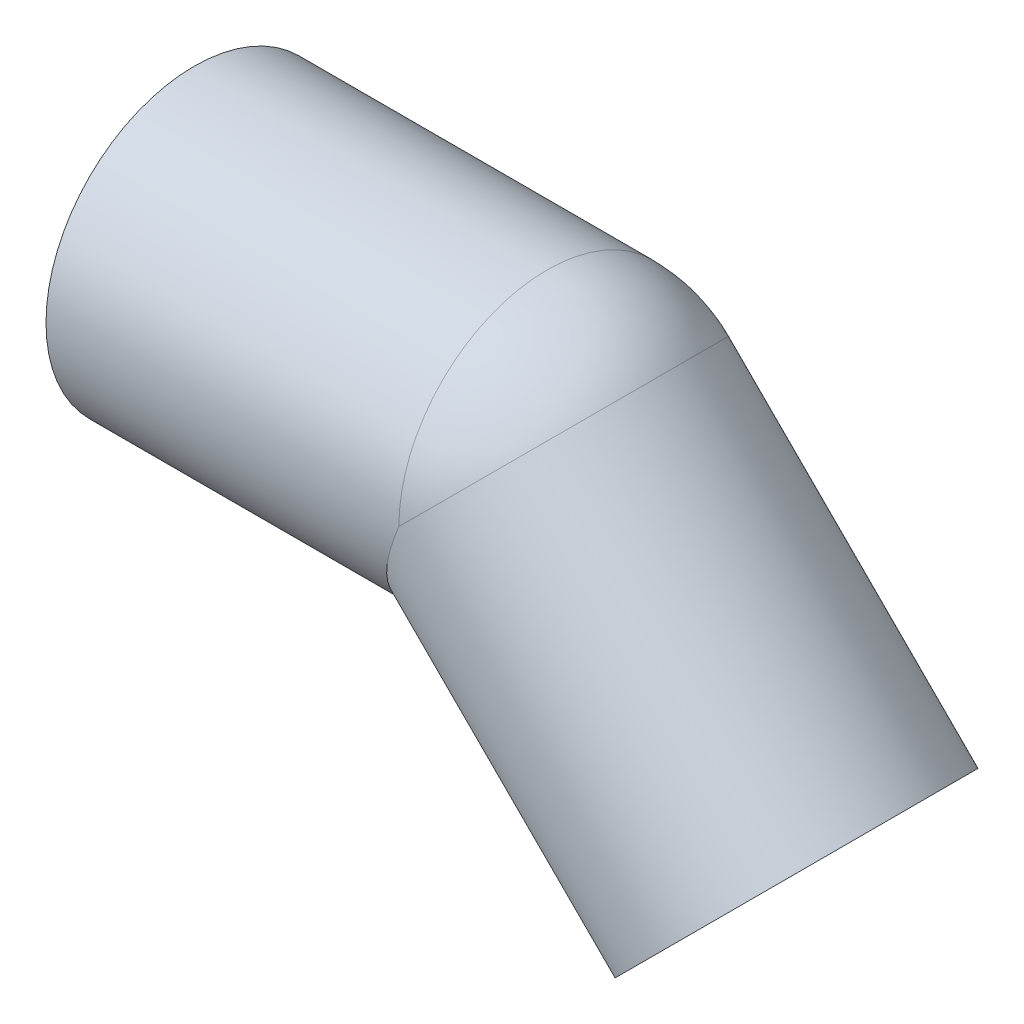
ISO-10303-21;
HEADER;
FILE_DESCRIPTION(('STEP AP214'),'2;1');
FILE_NAME('part.step','',(''),(''),'','','');
FILE_SCHEMA(('AUTOMOTIVE_DESIGN { 1 0 10303 214 1 1 1 1 }'));
ENDSEC;
DATA;
#1=APPLICATION_CONTEXT('core data for automotive mechanical design processes');
#2=APPLICATION_PROTOCOL_DEFINITION('international standard','automotive_design',2000,#1);
#3=PRODUCT_CONTEXT('',#1,'mechanical');
#4=PRODUCT('Part','Part','',(#3));
#5=PRODUCT_RELATED_PRODUCT_CATEGORY('part','',(#4));
#6=PRODUCT_DEFINITION_FORMATION('','',#4);
#7=PRODUCT_DEFINITION_CONTEXT('part definition',#1,'design');
#8=PRODUCT_DEFINITION('design','',#6,#7);
#9=PRODUCT_DEFINITION_SHAPE('','',#8);
#10=(LENGTH_UNIT() NAMED_UNIT(*) SI_UNIT(.MILLI.,.METRE.));
#11=(NAMED_UNIT(*) PLANE_ANGLE_UNIT() SI_UNIT($,.RADIAN.));
#12=(NAMED_UNIT(*) SI_UNIT($,.STERADIAN.) SOLID_ANGLE_UNIT());
#13=UNCERTAINTY_MEASURE_WITH_UNIT(LENGTH_MEASURE(1.E-05),#10,'distance_accuracy_value','');
#14=(GEOMETRIC_REPRESENTATION_CONTEXT(3) GLOBAL_UNCERTAINTY_ASSIGNED_CONTEXT((#13)) GLOBAL_UNIT_ASSIGNED_CONTEXT((#10,
#11,#12)) REPRESENTATION_CONTEXT('',''));
#15=CARTESIAN_POINT('',(0.,0.,0.));
#16=DIRECTION('',(0.,0.,1.));
#17=DIRECTION('',(1.,0.,0.));
#18=AXIS2_PLACEMENT_3D('',#15,#16,#17);
#19=CARTESIAN_POINT('',(128.033008588991,-53.033008588991,0.));
#20=DIRECTION('',(-0.70710678118655,0.707106781186546,0.));
#21=DIRECTION('',(-0.707106781186546,-0.70710678118655,0.));
#22=AXIS2_PLACEMENT_3D('',#19,#20,#21);
#23=CYLINDRICAL_SURFACE('',#22,28.5);
#24=CARTESIAN_POINT('',(75.,0.,0.));
#25=DIRECTION('',(0.707106781186547,-0.707106781186548,0.));
#26=DIRECTION('',(0.,0.,-1.));
#27=AXIS2_PLACEMENT_3D('',#24,#25,#26);
#28=CIRCLE('',#27,28.5);
#29=CARTESIAN_POINT('',(95.1525432656632,20.15254326197,0.));
#30=VERTEX_POINT('',#29);
#31=CARTESIAN_POINT('',(74.9999999999998,0.,28.5));
#32=VERTEX_POINT('',#31);
#33=EDGE_CURVE('E53',#30,#32,#28,.T.);
#34=ORIENTED_EDGE('',*,*,#33,.F.);
#35=CARTESIAN_POINT('',(75.,0.,0.));
#36=DIRECTION('',(0.707106780992169,-0.707106781380926,0.));
#37=DIRECTION('',(0.,0.,-1.));
#38=AXIS2_PLACEMENT_3D('',#35,#36,#37);
#39=CIRCLE('',#38,28.5);
#40=CARTESIAN_POINT('',(74.9999999999998,0.,-28.5));
#41=VERTEX_POINT('',#40);
#42=EDGE_CURVE('E46',#41,#30,#39,.T.);
#43=ORIENTED_EDGE('',*,*,#42,.F.);
#44=CARTESIAN_POINT('',(74.9999999999998,0.,0.));
#45=DIRECTION('',(-0.923879532511287,0.382683432365088,0.));
#46=DIRECTION('',(-0.382683432365088,-0.923879532511287,0.));
#47=AXIS2_PLACEMENT_3D('',#44,#45,#46);
#48=ELLIPSE('',#47,30.8481777083332,28.5);
#49=EDGE_CURVE('E55',#32,#41,#48,.F.);
#50=ORIENTED_EDGE('',*,*,#49,.F.);
#51=EDGE_LOOP('',(#34,#43,#50));
#52=FACE_BOUND('',#51,.T.);
#53=CARTESIAN_POINT('',(128.033008588991,-53.0330085889911,0.));
#54=DIRECTION('',(-0.707106781186549,0.707106781186546,0.));
#55=DIRECTION('',(-0.707106781186546,-0.707106781186549,0.));
#56=AXIS2_PLACEMENT_3D('',#53,#54,#55);
#57=CIRCLE('',#56,28.5);
#58=CARTESIAN_POINT('',(107.880465325175,-73.1855518528077,0.));
#59=VERTEX_POINT('',#58);
#60=EDGE_CURVE('E18',#59,#59,#57,.T.);
#61=ORIENTED_EDGE('',*,*,#60,.F.);
#62=EDGE_LOOP('',(#61));
#63=FACE_BOUND('',#62,.T.);
#64=ADVANCED_FACE('F15',(#52,#63),#23,.F.);
#65=CARTESIAN_POINT('',(75.,0.,0.));
#66=DIRECTION('',(0.,0.,1.));
#67=DIRECTION('',(-1.,0.,0.));
#68=AXIS2_PLACEMENT_3D('',#65,#66,#67);
#69=SPHERICAL_SURFACE('',#68,28.5);
#70=CARTESIAN_POINT('',(75.,0.,0.));
#71=DIRECTION('',(-1.,0.,0.));
#72=DIRECTION('',(0.,1.,0.));
#73=AXIS2_PLACEMENT_3D('',#70,#71,#72);
#74=CIRCLE('',#73,28.5);
#75=EDGE_CURVE('E51',#41,#32,#74,.F.);
#76=ORIENTED_EDGE('',*,*,#75,.F.);
#77=ORIENTED_EDGE('',*,*,#42,.T.);
#78=ORIENTED_EDGE('',*,*,#33,.T.);
#79=EDGE_LOOP('',(#76,#77,#78));
#80=FACE_BOUND('',#79,.T.);
#81=ADVANCED_FACE('F58',(#80),#69,.F.);
#82=CARTESIAN_POINT('',(150.306872196371,-30.7591449816114,31.878001054162));
#83=DIRECTION('',(0.707106781186547,-0.707106781186548,0.));
#84=DIRECTION('',(-0.707106781186548,-0.707106781186547,0.));
#85=AXIS2_PLACEMENT_3D('',#82,#83,#84);
#86=PLANE('',#85);
#87=ORIENTED_EDGE('',*,*,#60,.T.);
#88=EDGE_LOOP('',(#87));
#89=FACE_BOUND('',#88,.T.);
#90=CARTESIAN_POINT('',(128.033008588991,-53.0330085889911,0.));
#91=DIRECTION('',(-0.70710678118655,0.707106781186546,0.));
#92=DIRECTION('',(-0.707106781186546,-0.70710678118655,0.));
#93=AXIS2_PLACEMENT_3D('',#90,#91,#92);
#94=CIRCLE('',#93,31.5);
#95=CARTESIAN_POINT('',(105.759144981615,-75.3068721963674,0.));
#96=VERTEX_POINT('',#95);
#97=EDGE_CURVE('E75',#96,#96,#94,.T.);
#98=ORIENTED_EDGE('',*,*,#97,.F.);
#99=EDGE_LOOP('',(#98));
#100=FACE_BOUND('',#99,.T.);
#101=ADVANCED_FACE('F85',(#89,#100),#86,.T.);
#102=CARTESIAN_POINT('',(75.,0.,0.));
#103=DIRECTION('',(-1.,0.,0.));
#104=DIRECTION('',(0.,0.,1.));
#105=AXIS2_PLACEMENT_3D('',#102,#103,#104);
#106=CYLINDRICAL_SURFACE('',#105,28.5);
#107=CARTESIAN_POINT('',(0.,0.,0.));
#108=DIRECTION('',(-1.,0.,0.));
#109=DIRECTION('',(0.,0.,1.));
#110=AXIS2_PLACEMENT_3D('',#107,#108,#109);
#111=CIRCLE('',#110,28.5);
#112=CARTESIAN_POINT('',(0.,0.,28.5));
#113=VERTEX_POINT('',#112);
#114=EDGE_CURVE('E72',#113,#113,#111,.F.);
#115=ORIENTED_EDGE('',*,*,#114,.F.);
#116=EDGE_LOOP('',(#115));
#117=FACE_BOUND('',#116,.T.);
#118=ORIENTED_EDGE('',*,*,#49,.T.);
#119=ORIENTED_EDGE('',*,*,#75,.T.);
#120=EDGE_LOOP('',(#118,#119));
#121=FACE_BOUND('',#120,.T.);
#122=ADVANCED_FACE('F88',(#117,#121),#106,.F.);
#123=CARTESIAN_POINT('',(75.,0.,0.));
#124=DIRECTION('',(0.,0.,1.));
#125=DIRECTION('',(1.,0.,0.));
#126=AXIS2_PLACEMENT_3D('',#123,#124,#125);
#127=SPHERICAL_SURFACE('',#126,31.5);
#128=CARTESIAN_POINT('',(75.,0.,0.));
#129=DIRECTION('',(-1.,0.,0.));
#130=DIRECTION('',(0.,1.,0.));
#131=AXIS2_PLACEMENT_3D('',#128,#129,#130);
#132=CIRCLE('',#131,31.5);
#133=CARTESIAN_POINT('',(74.9999999999999,0.,31.5));
#134=VERTEX_POINT('',#133);
#135=CARTESIAN_POINT('',(74.9999999999999,0.,-31.5));
#136=VERTEX_POINT('',#135);
#137=EDGE_CURVE('E71',#134,#136,#132,.T.);
#138=ORIENTED_EDGE('',*,*,#137,.F.);
#139=CARTESIAN_POINT('',(75.,0.,0.));
#140=DIRECTION('',(-0.707106781161533,0.707106781211562,0.));
#141=DIRECTION('',(0.,0.,1.));
#142=AXIS2_PLACEMENT_3D('',#139,#140,#141);
#143=CIRCLE('',#142,31.5);
#144=CARTESIAN_POINT('',(97.2738636077702,22.2738636069823,0.));
#145=VERTEX_POINT('',#144);
#146=EDGE_CURVE('E77',#134,#145,#143,.T.);
#147=ORIENTED_EDGE('',*,*,#146,.T.);
#148=CARTESIAN_POINT('',(74.9999999999999,0.,0.));
#149=DIRECTION('',(-0.707106781186549,0.707106781186546,0.));
#150=DIRECTION('',(0.707106781186546,0.707106781186549,0.));
#151=AXIS2_PLACEMENT_3D('',#148,#149,#150);
#152=CIRCLE('',#151,31.5000000000001);
#153=EDGE_CURVE('E33',#136,#145,#152,.F.);
#154=ORIENTED_EDGE('',*,*,#153,.F.);
#155=EDGE_LOOP('',(#138,#147,#154));
#156=FACE_BOUND('',#155,.T.);
#157=ADVANCED_FACE('F92',(#156),#127,.T.);
#158=CARTESIAN_POINT('',(74.9999999999999,0.,0.));
#159=DIRECTION('',(-0.70710678118655,0.707106781186546,0.));
#160=DIRECTION('',(-0.707106781186546,-0.70710678118655,0.));
#161=AXIS2_PLACEMENT_3D('',#158,#159,#160);
#162=CYLINDRICAL_SURFACE('',#161,31.5);
#163=ORIENTED_EDGE('',*,*,#97,.T.);
#164=EDGE_LOOP('',(#163));
#165=FACE_BOUND('',#164,.T.);
#166=CARTESIAN_POINT('',(74.9999999999998,0.,0.));
#167=DIRECTION('',(-0.923879532511287,0.382683432365088,0.));
#168=DIRECTION('',(0.382683432365088,0.923879532511287,0.));
#169=AXIS2_PLACEMENT_3D('',#166,#167,#168);
#170=ELLIPSE('',#169,34.0953543092104,31.5);
#171=EDGE_CURVE('E24',#136,#134,#170,.T.);
#172=ORIENTED_EDGE('',*,*,#171,.F.);
#173=ORIENTED_EDGE('',*,*,#153,.T.);
#174=ORIENTED_EDGE('',*,*,#146,.F.);
#175=EDGE_LOOP('',(#172,#173,#174));
#176=FACE_BOUND('',#175,.T.);
#177=ADVANCED_FACE('F97',(#165,#176),#162,.T.);
#178=CARTESIAN_POINT('',(0.,-31.5,31.8780010542674));
#179=DIRECTION('',(-1.,0.,0.));
#180=DIRECTION('',(0.,1.,0.));
#181=AXIS2_PLACEMENT_3D('',#178,#179,#180);
#182=PLANE('',#181);
#183=ORIENTED_EDGE('',*,*,#114,.T.);
#184=EDGE_LOOP('',(#183));
#185=FACE_BOUND('',#184,.T.);
#186=CARTESIAN_POINT('',(0.,0.,0.));
#187=DIRECTION('',(-1.,0.,0.));
#188=DIRECTION('',(0.,0.,1.));
#189=AXIS2_PLACEMENT_3D('',#186,#187,#188);
#190=CIRCLE('',#189,31.5);
#191=CARTESIAN_POINT('',(0.,0.,31.5));
#192=VERTEX_POINT('',#191);
#193=EDGE_CURVE('E9',#192,#192,#190,.F.);
#194=ORIENTED_EDGE('',*,*,#193,.F.);
#195=EDGE_LOOP('',(#194));
#196=FACE_BOUND('',#195,.T.);
#197=ADVANCED_FACE('F113',(#185,#196),#182,.T.);
#198=CARTESIAN_POINT('',(0.,0.,0.));
#199=DIRECTION('',(-1.,0.,0.));
#200=DIRECTION('',(0.,0.,1.));
#201=AXIS2_PLACEMENT_3D('',#198,#199,#200);
#202=CYLINDRICAL_SURFACE('',#201,31.5);
#203=ORIENTED_EDGE('',*,*,#171,.T.);
#204=ORIENTED_EDGE('',*,*,#137,.T.);
#205=EDGE_LOOP('',(#203,#204));
#206=FACE_BOUND('',#205,.T.);
#207=ORIENTED_EDGE('',*,*,#193,.T.);
#208=EDGE_LOOP('',(#207));
#209=FACE_BOUND('',#208,.T.);
#210=ADVANCED_FACE('F110',(#206,#209),#202,.T.);
#211=CLOSED_SHELL('',(#64,#81,#101,#122,#157,#177,#197,#210));
#212=MANIFOLD_SOLID_BREP('B1',#211);
#213=ADVANCED_BREP_SHAPE_REPRESENTATION('',(#18,#212),#14);
#214=SHAPE_DEFINITION_REPRESENTATION(#9,#213);
ENDSEC;
END-ISO-10303-21;
